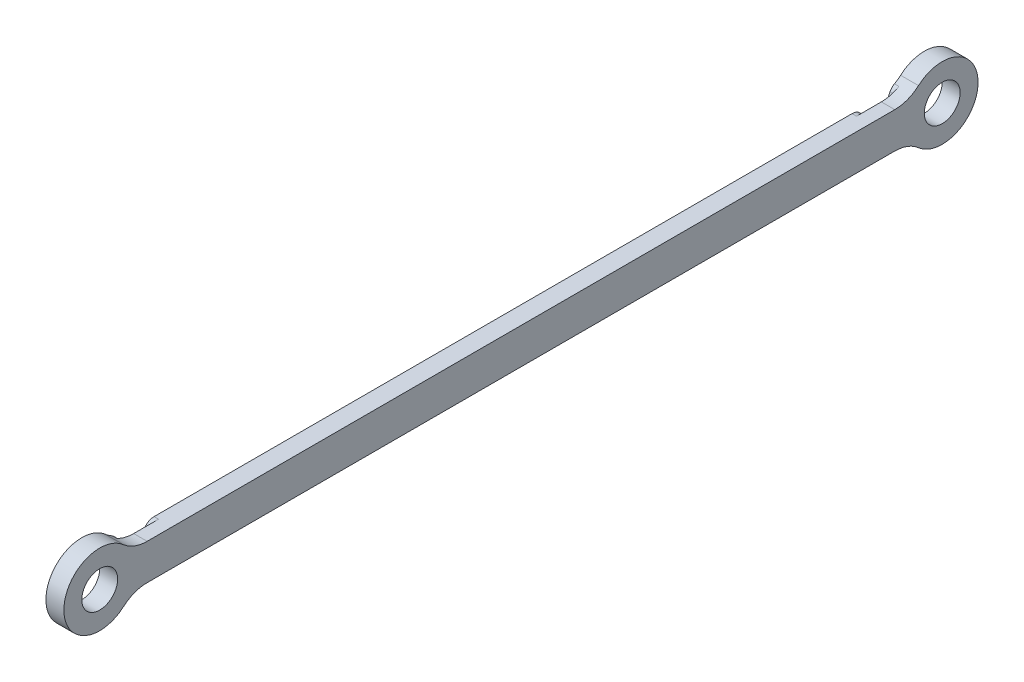
ISO-10303-21;
HEADER;
FILE_DESCRIPTION(('STEP AP214'),'2;1');
FILE_NAME('part.step','',(''),(''),'','','');
FILE_SCHEMA(('AUTOMOTIVE_DESIGN { 1 0 10303 214 1 1 1 1 }'));
ENDSEC;
DATA;
#1=APPLICATION_CONTEXT('core data for automotive mechanical design processes');
#2=APPLICATION_PROTOCOL_DEFINITION('international standard','automotive_design',2000,#1);
#3=PRODUCT_CONTEXT('',#1,'mechanical');
#4=PRODUCT('Part','Part','',(#3));
#5=PRODUCT_RELATED_PRODUCT_CATEGORY('part','',(#4));
#6=PRODUCT_DEFINITION_FORMATION('','',#4);
#7=PRODUCT_DEFINITION_CONTEXT('part definition',#1,'design');
#8=PRODUCT_DEFINITION('design','',#6,#7);
#9=PRODUCT_DEFINITION_SHAPE('','',#8);
#10=(LENGTH_UNIT() NAMED_UNIT(*) SI_UNIT(.MILLI.,.METRE.));
#11=(NAMED_UNIT(*) PLANE_ANGLE_UNIT() SI_UNIT($,.RADIAN.));
#12=(NAMED_UNIT(*) SI_UNIT($,.STERADIAN.) SOLID_ANGLE_UNIT());
#13=UNCERTAINTY_MEASURE_WITH_UNIT(LENGTH_MEASURE(1.E-05),#10,'distance_accuracy_value','');
#14=(GEOMETRIC_REPRESENTATION_CONTEXT(3) GLOBAL_UNCERTAINTY_ASSIGNED_CONTEXT((#13)) GLOBAL_UNIT_ASSIGNED_CONTEXT((#10,
#11,#12)) REPRESENTATION_CONTEXT('',''));
#15=CARTESIAN_POINT('',(0.,0.,0.));
#16=DIRECTION('',(0.,0.,1.));
#17=DIRECTION('',(1.,0.,0.));
#18=AXIS2_PLACEMENT_3D('',#15,#16,#17);
#19=CARTESIAN_POINT('',(-1.5875,0.,0.));
#20=DIRECTION('',(1.,0.,0.));
#21=DIRECTION('',(0.,0.,-1.));
#22=AXIS2_PLACEMENT_3D('',#19,#20,#21);
#23=PLANE('',#22);
#24=CARTESIAN_POINT('',(-1.5875,0.,-149.225));
#25=DIRECTION('',(1.,0.,0.));
#26=DIRECTION('',(0.,0.,-1.));
#27=AXIS2_PLACEMENT_3D('',#24,#25,#26);
#28=CIRCLE('',#27,3.175);
#29=CARTESIAN_POINT('',(-1.5875,0.,-152.4));
#30=VERTEX_POINT('',#29);
#31=EDGE_CURVE('E364',#30,#30,#28,.T.);
#32=ORIENTED_EDGE('',*,*,#31,.T.);
#33=EDGE_LOOP('',(#32));
#34=FACE_BOUND('',#33,.T.);
#35=CARTESIAN_POINT('',(-1.5875,0.,-149.225));
#36=DIRECTION('',(1.,0.,0.));
#37=DIRECTION('',(0.,0.,-1.));
#38=AXIS2_PLACEMENT_3D('',#35,#36,#37);
#39=CIRCLE('',#38,6.858);
#40=CARTESIAN_POINT('',(-1.5875,-3.1721686456571,-143.144744241933));
#41=VERTEX_POINT('',#40);
#42=CARTESIAN_POINT('',(-1.5875,3.1721686456571,-143.144744241933));
#43=VERTEX_POINT('',#42);
#44=EDGE_CURVE('E498',#41,#43,#39,.F.);
#45=ORIENTED_EDGE('',*,*,#44,.T.);
#46=CARTESIAN_POINT('',(-1.5875,2.24706842820096,-144.917930523084));
#47=DIRECTION('',(1.,0.,0.));
#48=DIRECTION('',(0.,0.,-1.));
#49=AXIS2_PLACEMENT_3D('',#46,#47,#48);
#50=CIRCLE('',#49,2.);
#51=CARTESIAN_POINT('',(-1.5875,3.99028557114684,-143.937525508542));
#52=VERTEX_POINT('',#51);
#53=EDGE_CURVE('E290',#43,#52,#50,.F.);
#54=ORIENTED_EDGE('',*,*,#53,.T.);
#55=CARTESIAN_POINT('',(-1.5875,9.525,-140.82473958737));
#56=DIRECTION('',(1.,0.,0.));
#57=DIRECTION('',(0.,0.,-1.));
#58=AXIS2_PLACEMENT_3D('',#55,#56,#57);
#59=CIRCLE('',#58,6.35);
#60=CARTESIAN_POINT('',(-1.5875,4.76249999999999,-145.024869793685));
#61=VERTEX_POINT('',#60);
#62=EDGE_CURVE('E246',#52,#61,#59,.T.);
#63=ORIENTED_EDGE('',*,*,#62,.T.);
#64=CARTESIAN_POINT('',(-1.5875,0.,-149.225));
#65=DIRECTION('',(1.,0.,0.));
#66=DIRECTION('',(0.,0.,-1.));
#67=AXIS2_PLACEMENT_3D('',#64,#65,#66);
#68=CIRCLE('',#67,6.35);
#69=CARTESIAN_POINT('',(-1.5875,-4.76249999999999,-145.024869793685));
#70=VERTEX_POINT('',#69);
#71=EDGE_CURVE('E351',#70,#61,#68,.T.);
#72=ORIENTED_EDGE('',*,*,#71,.F.);
#73=CARTESIAN_POINT('',(-1.5875,-9.525,-140.82473958737));
#74=DIRECTION('',(1.,0.,0.));
#75=DIRECTION('',(0.,0.,-1.));
#76=AXIS2_PLACEMENT_3D('',#73,#74,#75);
#77=CIRCLE('',#76,6.35);
#78=CARTESIAN_POINT('',(-1.5875,-3.99028557114684,-143.937525508542));
#79=VERTEX_POINT('',#78);
#80=EDGE_CURVE('E250',#70,#79,#77,.T.);
#81=ORIENTED_EDGE('',*,*,#80,.T.);
#82=CARTESIAN_POINT('',(-1.5875,-2.24706842820097,-144.917930523084));
#83=DIRECTION('',(1.,0.,0.));
#84=DIRECTION('',(0.,0.,-1.));
#85=AXIS2_PLACEMENT_3D('',#82,#83,#84);
#86=CIRCLE('',#85,2.);
#87=EDGE_CURVE('E288',#79,#41,#86,.F.);
#88=ORIENTED_EDGE('',*,*,#87,.T.);
#89=EDGE_LOOP('',(#45,#54,#63,#72,#81,#88));
#90=FACE_BOUND('',#89,.T.);
#91=ADVANCED_FACE('F37',(#34,#90),#23,.F.);
#92=CARTESIAN_POINT('',(1.5875,9.525,-140.82473958737));
#93=DIRECTION('',(-1.,0.,0.));
#94=DIRECTION('',(0.,0.,1.));
#95=AXIS2_PLACEMENT_3D('',#92,#93,#94);
#96=CYLINDRICAL_SURFACE('',#95,6.35);
#97=ORIENTED_EDGE('',*,*,#62,.F.);
#98=DIRECTION('',(-1.,0.,0.));
#99=VECTOR('',#98,1.);
#100=CARTESIAN_POINT('',(1.5875,3.99028557114684,-143.937525508542));
#101=LINE('',#100,#99);
#102=CARTESIAN_POINT('',(-0.79375,3.99028557114684,-143.937525508542));
#103=VERTEX_POINT('',#102);
#104=EDGE_CURVE('E217',#52,#103,#101,.F.);
#105=ORIENTED_EDGE('',*,*,#104,.T.);
#106=CARTESIAN_POINT('',(-0.79375,9.525,-140.82473958737));
#107=DIRECTION('',(1.,0.,0.));
#108=DIRECTION('',(0.,0.,-1.));
#109=AXIS2_PLACEMENT_3D('',#106,#107,#108);
#110=CIRCLE('',#109,6.35);
#111=CARTESIAN_POINT('',(-0.79375,3.175,-140.82473958737));
#112=VERTEX_POINT('',#111);
#113=EDGE_CURVE('E199',#103,#112,#110,.F.);
#114=ORIENTED_EDGE('',*,*,#113,.T.);
#115=DIRECTION('',(-1.,0.,0.));
#116=VECTOR('',#115,1.);
#117=CARTESIAN_POINT('',(1.5875,3.175,-140.82473958737));
#118=LINE('',#117,#116);
#119=CARTESIAN_POINT('',(1.5875,3.175,-140.82473958737));
#120=VERTEX_POINT('',#119);
#121=EDGE_CURVE('E215',#120,#112,#118,.T.);
#122=ORIENTED_EDGE('',*,*,#121,.F.);
#123=CARTESIAN_POINT('',(1.5875,9.525,-140.82473958737));
#124=DIRECTION('',(1.,0.,0.));
#125=DIRECTION('',(0.,0.,-1.));
#126=AXIS2_PLACEMENT_3D('',#123,#124,#125);
#127=CIRCLE('',#126,6.35);
#128=CARTESIAN_POINT('',(1.5875,4.76249999999999,-145.024869793685));
#129=VERTEX_POINT('',#128);
#130=EDGE_CURVE('E248',#129,#120,#127,.F.);
#131=ORIENTED_EDGE('',*,*,#130,.F.);
#132=DIRECTION('',(-1.,0.,0.));
#133=VECTOR('',#132,1.);
#134=CARTESIAN_POINT('',(1.5875,4.76249999999999,-145.024869793685));
#135=LINE('',#134,#133);
#136=EDGE_CURVE('E229',#61,#129,#135,.F.);
#137=ORIENTED_EDGE('',*,*,#136,.F.);
#138=EDGE_LOOP('',(#97,#105,#114,#122,#131,#137));
#139=FACE_BOUND('',#138,.T.);
#140=ADVANCED_FACE('F213',(#139),#96,.F.);
#141=CARTESIAN_POINT('',(1.5875,-9.525,-140.82473958737));
#142=DIRECTION('',(-1.,0.,0.));
#143=DIRECTION('',(0.,0.,1.));
#144=AXIS2_PLACEMENT_3D('',#141,#142,#143);
#145=CYLINDRICAL_SURFACE('',#144,6.35);
#146=CARTESIAN_POINT('',(-0.79375,-9.525,-140.82473958737));
#147=DIRECTION('',(1.,0.,0.));
#148=DIRECTION('',(0.,0.,-1.));
#149=AXIS2_PLACEMENT_3D('',#146,#147,#148);
#150=CIRCLE('',#149,6.35);
#151=CARTESIAN_POINT('',(-0.79375,-3.175,-140.82473958737));
#152=VERTEX_POINT('',#151);
#153=CARTESIAN_POINT('',(-0.79375,-3.99028557114684,-143.937525508542));
#154=VERTEX_POINT('',#153);
#155=EDGE_CURVE('E485',#152,#154,#150,.F.);
#156=ORIENTED_EDGE('',*,*,#155,.T.);
#157=DIRECTION('',(-1.,0.,0.));
#158=VECTOR('',#157,1.);
#159=CARTESIAN_POINT('',(1.5875,-3.99028557114684,-143.937525508542));
#160=LINE('',#159,#158);
#161=EDGE_CURVE('E298',#154,#79,#160,.T.);
#162=ORIENTED_EDGE('',*,*,#161,.T.);
#163=ORIENTED_EDGE('',*,*,#80,.F.);
#164=DIRECTION('',(-1.,0.,0.));
#165=VECTOR('',#164,1.);
#166=CARTESIAN_POINT('',(1.5875,-4.76249999999999,-145.024869793685));
#167=LINE('',#166,#165);
#168=CARTESIAN_POINT('',(1.5875,-4.76249999999999,-145.024869793685));
#169=VERTEX_POINT('',#168);
#170=EDGE_CURVE('E225',#169,#70,#167,.T.);
#171=ORIENTED_EDGE('',*,*,#170,.F.);
#172=CARTESIAN_POINT('',(1.5875,-9.525,-140.82473958737));
#173=DIRECTION('',(1.,0.,0.));
#174=DIRECTION('',(0.,0.,-1.));
#175=AXIS2_PLACEMENT_3D('',#172,#173,#174);
#176=CIRCLE('',#175,6.35);
#177=CARTESIAN_POINT('',(1.5875,-3.175,-140.82473958737));
#178=VERTEX_POINT('',#177);
#179=EDGE_CURVE('E253',#178,#169,#176,.F.);
#180=ORIENTED_EDGE('',*,*,#179,.F.);
#181=DIRECTION('',(1.,0.,0.));
#182=VECTOR('',#181,1.);
#183=CARTESIAN_POINT('',(1.5875,-3.175,-140.82473958737));
#184=LINE('',#183,#182);
#185=EDGE_CURVE('E239',#152,#178,#184,.T.);
#186=ORIENTED_EDGE('',*,*,#185,.F.);
#187=EDGE_LOOP('',(#156,#162,#163,#171,#180,#186));
#188=FACE_BOUND('',#187,.T.);
#189=ADVANCED_FACE('F415',(#188),#145,.F.);
#190=CARTESIAN_POINT('',(1.5875,-3.175,0.));
#191=DIRECTION('',(0.,1.,0.));
#192=DIRECTION('',(0.,0.,1.));
#193=AXIS2_PLACEMENT_3D('',#190,#191,#192);
#194=PLANE('',#193);
#195=DIRECTION('',(0.,0.,-1.));
#196=VECTOR('',#195,1.);
#197=CARTESIAN_POINT('',(-1.5875,-3.175,0.));
#198=LINE('',#197,#196);
#199=CARTESIAN_POINT('',(-1.5875,-3.175,-12.8042001816454));
#200=VERTEX_POINT('',#199);
#201=CARTESIAN_POINT('',(-1.5875,-3.175,-136.420799818355));
#202=VERTEX_POINT('',#201);
#203=EDGE_CURVE('E345',#200,#202,#198,.T.);
#204=ORIENTED_EDGE('',*,*,#203,.T.);
#205=DIRECTION('',(-1.,0.,0.));
#206=VECTOR('',#205,1.);
#207=CARTESIAN_POINT('',(1.5875,-3.175,-136.420799818355));
#208=LINE('',#207,#206);
#209=CARTESIAN_POINT('',(-0.79375,-3.175,-136.420799818355));
#210=VERTEX_POINT('',#209);
#211=EDGE_CURVE('E280',#202,#210,#208,.F.);
#212=ORIENTED_EDGE('',*,*,#211,.T.);
#213=DIRECTION('',(0.,0.,-1.));
#214=VECTOR('',#213,1.);
#215=CARTESIAN_POINT('',(-0.79375,-3.175,-149.225));
#216=LINE('',#215,#214);
#217=EDGE_CURVE('E482',#210,#152,#216,.T.);
#218=ORIENTED_EDGE('',*,*,#217,.T.);
#219=ORIENTED_EDGE('',*,*,#185,.T.);
#220=DIRECTION('',(0.,0.,-1.));
#221=VECTOR('',#220,1.);
#222=CARTESIAN_POINT('',(1.5875,-3.175,0.));
#223=LINE('',#222,#221);
#224=CARTESIAN_POINT('',(1.5875,-3.175,-8.40026041263007));
#225=VERTEX_POINT('',#224);
#226=EDGE_CURVE('E372',#225,#178,#223,.T.);
#227=ORIENTED_EDGE('',*,*,#226,.F.);
#228=DIRECTION('',(1.,0.,0.));
#229=VECTOR('',#228,1.);
#230=CARTESIAN_POINT('',(-1.5875,-3.175,-8.40026041263007));
#231=LINE('',#230,#229);
#232=CARTESIAN_POINT('',(-0.79375,-3.175,-8.40026041263007));
#233=VERTEX_POINT('',#232);
#234=EDGE_CURVE('E236',#225,#233,#231,.F.);
#235=ORIENTED_EDGE('',*,*,#234,.T.);
#236=DIRECTION('',(0.,0.,1.));
#237=VECTOR('',#236,1.);
#238=CARTESIAN_POINT('',(-0.79375,-3.175,0.));
#239=LINE('',#238,#237);
#240=CARTESIAN_POINT('',(-0.79375,-3.175,-12.8042001816454));
#241=VERTEX_POINT('',#240);
#242=EDGE_CURVE('E336',#241,#233,#239,.T.);
#243=ORIENTED_EDGE('',*,*,#242,.F.);
#244=DIRECTION('',(1.,0.,0.));
#245=VECTOR('',#244,1.);
#246=CARTESIAN_POINT('',(-1.5875,-3.175,-12.8042001816454));
#247=LINE('',#246,#245);
#248=EDGE_CURVE('E277',#241,#200,#247,.F.);
#249=ORIENTED_EDGE('',*,*,#248,.T.);
#250=EDGE_LOOP('',(#204,#212,#218,#219,#227,#235,#243,#249));
#251=FACE_BOUND('',#250,.T.);
#252=ADVANCED_FACE('F344',(#251),#194,.F.);
#253=CARTESIAN_POINT('',(1.5875,3.175,0.));
#254=DIRECTION('',(0.,1.,0.));
#255=DIRECTION('',(0.,0.,1.));
#256=AXIS2_PLACEMENT_3D('',#253,#254,#255);
#257=PLANE('',#256);
#258=DIRECTION('',(0.,0.,1.));
#259=VECTOR('',#258,1.);
#260=CARTESIAN_POINT('',(-0.79375,3.175,-149.225));
#261=LINE('',#260,#259);
#262=CARTESIAN_POINT('',(-0.79375,3.175,-136.420799818355));
#263=VERTEX_POINT('',#262);
#264=EDGE_CURVE('E196',#112,#263,#261,.T.);
#265=ORIENTED_EDGE('',*,*,#264,.T.);
#266=DIRECTION('',(1.,0.,0.));
#267=VECTOR('',#266,1.);
#268=CARTESIAN_POINT('',(-1.5875,3.175,-136.420799818355));
#269=LINE('',#268,#267);
#270=CARTESIAN_POINT('',(-1.5875,3.175,-136.420799818355));
#271=VERTEX_POINT('',#270);
#272=EDGE_CURVE('E296',#263,#271,#269,.F.);
#273=ORIENTED_EDGE('',*,*,#272,.T.);
#274=DIRECTION('',(0.,0.,-1.));
#275=VECTOR('',#274,1.);
#276=CARTESIAN_POINT('',(-1.5875,3.175,0.));
#277=LINE('',#276,#275);
#278=CARTESIAN_POINT('',(-1.5875,3.175,-12.8042001816454));
#279=VERTEX_POINT('',#278);
#280=EDGE_CURVE('E355',#279,#271,#277,.T.);
#281=ORIENTED_EDGE('',*,*,#280,.F.);
#282=DIRECTION('',(-1.,0.,0.));
#283=VECTOR('',#282,1.);
#284=CARTESIAN_POINT('',(1.5875,3.175,-12.8042001816454));
#285=LINE('',#284,#283);
#286=CARTESIAN_POINT('',(-0.79375,3.175,-12.8042001816454));
#287=VERTEX_POINT('',#286);
#288=EDGE_CURVE('E293',#279,#287,#285,.F.);
#289=ORIENTED_EDGE('',*,*,#288,.T.);
#290=DIRECTION('',(0.,0.,-1.));
#291=VECTOR('',#290,1.);
#292=CARTESIAN_POINT('',(-0.79375,3.175,0.));
#293=LINE('',#292,#291);
#294=CARTESIAN_POINT('',(-0.79375,3.175,-8.40026041263007));
#295=VERTEX_POINT('',#294);
#296=EDGE_CURVE('E358',#295,#287,#293,.T.);
#297=ORIENTED_EDGE('',*,*,#296,.F.);
#298=DIRECTION('',(-1.,0.,0.));
#299=VECTOR('',#298,1.);
#300=CARTESIAN_POINT('',(1.5875,3.175,-8.40026041263007));
#301=LINE('',#300,#299);
#302=CARTESIAN_POINT('',(1.5875,3.175,-8.40026041263007));
#303=VERTEX_POINT('',#302);
#304=EDGE_CURVE('E226',#295,#303,#301,.F.);
#305=ORIENTED_EDGE('',*,*,#304,.T.);
#306=DIRECTION('',(0.,0.,-1.));
#307=VECTOR('',#306,1.);
#308=CARTESIAN_POINT('',(1.5875,3.175,0.));
#309=LINE('',#308,#307);
#310=EDGE_CURVE('E224',#303,#120,#309,.T.);
#311=ORIENTED_EDGE('',*,*,#310,.T.);
#312=ORIENTED_EDGE('',*,*,#121,.T.);
#313=EDGE_LOOP('',(#265,#273,#281,#289,#297,#305,#311,#312));
#314=FACE_BOUND('',#313,.T.);
#315=ADVANCED_FACE('F222',(#314),#257,.T.);
#316=CARTESIAN_POINT('',(-1.5875,0.,-149.225));
#317=DIRECTION('',(1.,0.,0.));
#318=DIRECTION('',(0.,0.,-1.));
#319=AXIS2_PLACEMENT_3D('',#316,#317,#318);
#320=CIRCLE('',#319,10.858000128);
#321=CARTESIAN_POINT('',(-1.5875,-0.992234408414526,-138.412431495782));
#322=VERTEX_POINT('',#321);
#323=CARTESIAN_POINT('',(-1.5875,0.992234408414526,-138.412431495782));
#324=VERTEX_POINT('',#323);
#325=EDGE_CURVE('E501',#322,#324,#320,.F.);
#326=ORIENTED_EDGE('',*,*,#325,.F.);
#327=CARTESIAN_POINT('',(-1.5875,-1.175,-136.420799818355));
#328=DIRECTION('',(1.,0.,0.));
#329=DIRECTION('',(0.,0.,-1.));
#330=AXIS2_PLACEMENT_3D('',#327,#328,#329);
#331=CIRCLE('',#330,2.);
#332=EDGE_CURVE('E275',#322,#202,#331,.F.);
#333=ORIENTED_EDGE('',*,*,#332,.T.);
#334=ORIENTED_EDGE('',*,*,#203,.F.);
#335=CARTESIAN_POINT('',(-1.5875,-1.175,-12.8042001816454));
#336=DIRECTION('',(1.,0.,0.));
#337=DIRECTION('',(0.,0.,-1.));
#338=AXIS2_PLACEMENT_3D('',#335,#336,#337);
#339=CIRCLE('',#338,2.);
#340=CARTESIAN_POINT('',(-1.5875,-0.992234408414528,-10.812568504218));
#341=VERTEX_POINT('',#340);
#342=EDGE_CURVE('E271',#200,#341,#339,.F.);
#343=ORIENTED_EDGE('',*,*,#342,.T.);
#344=CARTESIAN_POINT('',(-1.5875,0.,0.));
#345=DIRECTION('',(-1.,0.,0.));
#346=DIRECTION('',(0.,0.,1.));
#347=AXIS2_PLACEMENT_3D('',#344,#345,#346);
#348=CIRCLE('',#347,10.858000128);
#349=CARTESIAN_POINT('',(-1.5875,0.992234408414528,-10.812568504218));
#350=VERTEX_POINT('',#349);
#351=EDGE_CURVE('E480',#341,#350,#348,.F.);
#352=ORIENTED_EDGE('',*,*,#351,.T.);
#353=CARTESIAN_POINT('',(-1.5875,1.175,-12.8042001816454));
#354=DIRECTION('',(1.,0.,0.));
#355=DIRECTION('',(0.,0.,-1.));
#356=AXIS2_PLACEMENT_3D('',#353,#354,#355);
#357=CIRCLE('',#356,2.);
#358=EDGE_CURVE('E269',#350,#279,#357,.F.);
#359=ORIENTED_EDGE('',*,*,#358,.T.);
#360=ORIENTED_EDGE('',*,*,#280,.T.);
#361=CARTESIAN_POINT('',(-1.5875,1.175,-136.420799818355));
#362=DIRECTION('',(1.,0.,0.));
#363=DIRECTION('',(0.,0.,-1.));
#364=AXIS2_PLACEMENT_3D('',#361,#362,#363);
#365=CIRCLE('',#364,2.);
#366=EDGE_CURVE('E273',#271,#324,#365,.F.);
#367=ORIENTED_EDGE('',*,*,#366,.T.);
#368=EDGE_LOOP('',(#326,#333,#334,#343,#352,#359,#360,#367));
#369=FACE_BOUND('',#368,.T.);
#370=ADVANCED_FACE('F349',(#369),#23,.F.);
#371=CARTESIAN_POINT('',(1.5875,0.,0.));
#372=DIRECTION('',(-1.,0.,0.));
#373=DIRECTION('',(0.,0.,1.));
#374=AXIS2_PLACEMENT_3D('',#371,#372,#373);
#375=CYLINDRICAL_SURFACE('',#374,6.35);
#376=CARTESIAN_POINT('',(-1.5875,0.,0.));
#377=DIRECTION('',(1.,0.,0.));
#378=DIRECTION('',(0.,0.,-1.));
#379=AXIS2_PLACEMENT_3D('',#376,#377,#378);
#380=CIRCLE('',#379,6.35);
#381=CARTESIAN_POINT('',(-1.5875,4.7625,-4.20013020631504));
#382=VERTEX_POINT('',#381);
#383=CARTESIAN_POINT('',(-1.5875,-4.7625,-4.20013020631504));
#384=VERTEX_POINT('',#383);
#385=EDGE_CURVE('E352',#382,#384,#380,.T.);
#386=ORIENTED_EDGE('',*,*,#385,.T.);
#387=DIRECTION('',(-1.,0.,0.));
#388=VECTOR('',#387,1.);
#389=CARTESIAN_POINT('',(1.5875,-4.7625,-4.20013020631504));
#390=LINE('',#389,#388);
#391=CARTESIAN_POINT('',(1.5875,-4.7625,-4.20013020631504));
#392=VERTEX_POINT('',#391);
#393=EDGE_CURVE('E244',#384,#392,#390,.F.);
#394=ORIENTED_EDGE('',*,*,#393,.T.);
#395=CARTESIAN_POINT('',(1.5875,0.,0.));
#396=DIRECTION('',(1.,0.,0.));
#397=DIRECTION('',(0.,0.,-1.));
#398=AXIS2_PLACEMENT_3D('',#395,#396,#397);
#399=CIRCLE('',#398,6.35);
#400=CARTESIAN_POINT('',(1.5875,4.7625,-4.20013020631504));
#401=VERTEX_POINT('',#400);
#402=EDGE_CURVE('E368',#401,#392,#399,.T.);
#403=ORIENTED_EDGE('',*,*,#402,.F.);
#404=DIRECTION('',(-1.,0.,0.));
#405=VECTOR('',#404,1.);
#406=CARTESIAN_POINT('',(1.5875,4.7625,-4.20013020631504));
#407=LINE('',#406,#405);
#408=EDGE_CURVE('E241',#401,#382,#407,.T.);
#409=ORIENTED_EDGE('',*,*,#408,.T.);
#410=EDGE_LOOP('',(#386,#394,#403,#409));
#411=FACE_BOUND('',#410,.T.);
#412=ADVANCED_FACE('F419',(#411),#375,.T.);
#413=CARTESIAN_POINT('',(1.5875,0.,-149.225));
#414=DIRECTION('',(-1.,0.,0.));
#415=DIRECTION('',(0.,0.,1.));
#416=AXIS2_PLACEMENT_3D('',#413,#414,#415);
#417=CYLINDRICAL_SURFACE('',#416,6.35);
#418=ORIENTED_EDGE('',*,*,#71,.T.);
#419=ORIENTED_EDGE('',*,*,#136,.T.);
#420=CARTESIAN_POINT('',(1.5875,0.,-149.225));
#421=DIRECTION('',(1.,0.,0.));
#422=DIRECTION('',(0.,0.,-1.));
#423=AXIS2_PLACEMENT_3D('',#420,#421,#422);
#424=CIRCLE('',#423,6.35);
#425=EDGE_CURVE('E378',#169,#129,#424,.T.);
#426=ORIENTED_EDGE('',*,*,#425,.F.);
#427=ORIENTED_EDGE('',*,*,#170,.T.);
#428=EDGE_LOOP('',(#418,#419,#426,#427));
#429=FACE_BOUND('',#428,.T.);
#430=ADVANCED_FACE('F424',(#429),#417,.T.);
#431=CARTESIAN_POINT('',(1.5875,0.,-149.225));
#432=DIRECTION('',(-1.,0.,0.));
#433=DIRECTION('',(0.,0.,1.));
#434=AXIS2_PLACEMENT_3D('',#431,#432,#433);
#435=CYLINDRICAL_SURFACE('',#434,3.175);
#436=CARTESIAN_POINT('',(1.5875,0.,-149.225));
#437=DIRECTION('',(1.,0.,0.));
#438=DIRECTION('',(0.,0.,-1.));
#439=AXIS2_PLACEMENT_3D('',#436,#437,#438);
#440=CIRCLE('',#439,3.175);
#441=CARTESIAN_POINT('',(1.5875,0.,-152.4));
#442=VERTEX_POINT('',#441);
#443=EDGE_CURVE('E387',#442,#442,#440,.T.);
#444=ORIENTED_EDGE('',*,*,#443,.T.);
#445=EDGE_LOOP('',(#444));
#446=FACE_BOUND('',#445,.T.);
#447=ORIENTED_EDGE('',*,*,#31,.F.);
#448=EDGE_LOOP('',(#447));
#449=FACE_BOUND('',#448,.T.);
#450=ADVANCED_FACE('F406',(#446,#449),#435,.F.);
#451=CARTESIAN_POINT('',(1.5875,0.,0.));
#452=DIRECTION('',(-1.,0.,0.));
#453=DIRECTION('',(0.,0.,1.));
#454=AXIS2_PLACEMENT_3D('',#451,#452,#453);
#455=CYLINDRICAL_SURFACE('',#454,3.175);
#456=CARTESIAN_POINT('',(1.5875,0.,0.));
#457=DIRECTION('',(1.,0.,0.));
#458=DIRECTION('',(0.,0.,-1.));
#459=AXIS2_PLACEMENT_3D('',#456,#457,#458);
#460=CIRCLE('',#459,3.175);
#461=CARTESIAN_POINT('',(1.5875,0.,-3.175));
#462=VERTEX_POINT('',#461);
#463=EDGE_CURVE('E231',#462,#462,#460,.T.);
#464=ORIENTED_EDGE('',*,*,#463,.T.);
#465=EDGE_LOOP('',(#464));
#466=FACE_BOUND('',#465,.T.);
#467=CARTESIAN_POINT('',(-1.5875,0.,0.));
#468=DIRECTION('',(1.,0.,0.));
#469=DIRECTION('',(0.,0.,-1.));
#470=AXIS2_PLACEMENT_3D('',#467,#468,#469);
#471=CIRCLE('',#470,3.175);
#472=CARTESIAN_POINT('',(-1.5875,0.,-3.175));
#473=VERTEX_POINT('',#472);
#474=EDGE_CURVE('E366',#473,#473,#471,.T.);
#475=ORIENTED_EDGE('',*,*,#474,.F.);
#476=EDGE_LOOP('',(#475));
#477=FACE_BOUND('',#476,.T.);
#478=ADVANCED_FACE('F392',(#466,#477),#455,.F.);
#479=CARTESIAN_POINT('',(1.5875,0.,0.));
#480=DIRECTION('',(1.,0.,0.));
#481=DIRECTION('',(0.,0.,-1.));
#482=AXIS2_PLACEMENT_3D('',#479,#480,#481);
#483=PLANE('',#482);
#484=ORIENTED_EDGE('',*,*,#310,.F.);
#485=CARTESIAN_POINT('',(1.5875,9.525,-8.40026041263007));
#486=DIRECTION('',(1.,0.,0.));
#487=DIRECTION('',(0.,0.,-1.));
#488=AXIS2_PLACEMENT_3D('',#485,#486,#487);
#489=CIRCLE('',#488,6.35);
#490=EDGE_CURVE('E262',#303,#401,#489,.F.);
#491=ORIENTED_EDGE('',*,*,#490,.T.);
#492=ORIENTED_EDGE('',*,*,#402,.T.);
#493=CARTESIAN_POINT('',(1.5875,-9.525,-8.40026041263007));
#494=DIRECTION('',(1.,0.,0.));
#495=DIRECTION('',(0.,0.,-1.));
#496=AXIS2_PLACEMENT_3D('',#493,#494,#495);
#497=CIRCLE('',#496,6.35);
#498=EDGE_CURVE('E257',#392,#225,#497,.F.);
#499=ORIENTED_EDGE('',*,*,#498,.T.);
#500=ORIENTED_EDGE('',*,*,#226,.T.);
#501=ORIENTED_EDGE('',*,*,#179,.T.);
#502=ORIENTED_EDGE('',*,*,#425,.T.);
#503=ORIENTED_EDGE('',*,*,#130,.T.);
#504=EDGE_LOOP('',(#484,#491,#492,#499,#500,#501,#502,#503));
#505=FACE_BOUND('',#504,.T.);
#506=ORIENTED_EDGE('',*,*,#443,.F.);
#507=EDGE_LOOP('',(#506));
#508=FACE_BOUND('',#507,.T.);
#509=ORIENTED_EDGE('',*,*,#463,.F.);
#510=EDGE_LOOP('',(#509));
#511=FACE_BOUND('',#510,.T.);
#512=ADVANCED_FACE('F395',(#505,#508,#511),#483,.T.);
#513=CARTESIAN_POINT('',(-1.5875,9.525,-8.40026041263007));
#514=DIRECTION('',(1.,0.,0.));
#515=DIRECTION('',(0.,0.,-1.));
#516=AXIS2_PLACEMENT_3D('',#513,#514,#515);
#517=CIRCLE('',#516,6.35);
#518=CARTESIAN_POINT('',(-1.5875,3.99028557114685,-5.28747449145837));
#519=VERTEX_POINT('',#518);
#520=EDGE_CURVE('E259',#382,#519,#517,.T.);
#521=ORIENTED_EDGE('',*,*,#520,.T.);
#522=CARTESIAN_POINT('',(-1.5875,2.24706842820098,-4.30706947691611));
#523=DIRECTION('',(1.,0.,0.));
#524=DIRECTION('',(0.,0.,-1.));
#525=AXIS2_PLACEMENT_3D('',#522,#523,#524);
#526=CIRCLE('',#525,2.);
#527=CARTESIAN_POINT('',(-1.5875,3.17216864565712,-6.08025575806724));
#528=VERTEX_POINT('',#527);
#529=EDGE_CURVE('E306',#519,#528,#526,.F.);
#530=ORIENTED_EDGE('',*,*,#529,.T.);
#531=CARTESIAN_POINT('',(-1.5875,0.,0.));
#532=DIRECTION('',(-1.,0.,0.));
#533=DIRECTION('',(0.,0.,1.));
#534=AXIS2_PLACEMENT_3D('',#531,#532,#533);
#535=CIRCLE('',#534,6.858);
#536=CARTESIAN_POINT('',(-1.5875,-3.17216864565712,-6.08025575806724));
#537=VERTEX_POINT('',#536);
#538=EDGE_CURVE('E381',#537,#528,#535,.F.);
#539=ORIENTED_EDGE('',*,*,#538,.F.);
#540=CARTESIAN_POINT('',(-1.5875,-2.24706842820097,-4.30706947691611));
#541=DIRECTION('',(1.,0.,0.));
#542=DIRECTION('',(0.,0.,-1.));
#543=AXIS2_PLACEMENT_3D('',#540,#541,#542);
#544=CIRCLE('',#543,2.);
#545=CARTESIAN_POINT('',(-1.5875,-3.99028557114685,-5.28747449145838));
#546=VERTEX_POINT('',#545);
#547=EDGE_CURVE('E304',#537,#546,#544,.F.);
#548=ORIENTED_EDGE('',*,*,#547,.T.);
#549=CARTESIAN_POINT('',(-1.5875,-9.525,-8.40026041263007));
#550=DIRECTION('',(1.,0.,0.));
#551=DIRECTION('',(0.,0.,-1.));
#552=AXIS2_PLACEMENT_3D('',#549,#550,#551);
#553=CIRCLE('',#552,6.35);
#554=EDGE_CURVE('E255',#546,#384,#553,.T.);
#555=ORIENTED_EDGE('',*,*,#554,.T.);
#556=ORIENTED_EDGE('',*,*,#385,.F.);
#557=EDGE_LOOP('',(#521,#530,#539,#548,#555,#556));
#558=FACE_BOUND('',#557,.T.);
#559=ORIENTED_EDGE('',*,*,#474,.T.);
#560=EDGE_LOOP('',(#559));
#561=FACE_BOUND('',#560,.T.);
#562=ADVANCED_FACE('F397',(#558,#561),#23,.F.);
#563=CARTESIAN_POINT('',(1.5875,-9.525,-8.40026041263007));
#564=DIRECTION('',(-1.,0.,0.));
#565=DIRECTION('',(0.,0.,1.));
#566=AXIS2_PLACEMENT_3D('',#563,#564,#565);
#567=CYLINDRICAL_SURFACE('',#566,6.35);
#568=ORIENTED_EDGE('',*,*,#554,.F.);
#569=DIRECTION('',(-1.,0.,0.));
#570=VECTOR('',#569,1.);
#571=CARTESIAN_POINT('',(1.5875,-3.99028557114685,-5.28747449145838));
#572=LINE('',#571,#570);
#573=CARTESIAN_POINT('',(-0.79375,-3.99028557114685,-5.28747449145838));
#574=VERTEX_POINT('',#573);
#575=EDGE_CURVE('E313',#546,#574,#572,.F.);
#576=ORIENTED_EDGE('',*,*,#575,.T.);
#577=CARTESIAN_POINT('',(-0.79375,-9.525,-8.40026041263007));
#578=DIRECTION('',(-1.,0.,0.));
#579=DIRECTION('',(0.,0.,1.));
#580=AXIS2_PLACEMENT_3D('',#577,#578,#579);
#581=CIRCLE('',#580,6.35);
#582=EDGE_CURVE('E494',#233,#574,#581,.F.);
#583=ORIENTED_EDGE('',*,*,#582,.F.);
#584=ORIENTED_EDGE('',*,*,#234,.F.);
#585=ORIENTED_EDGE('',*,*,#498,.F.);
#586=ORIENTED_EDGE('',*,*,#393,.F.);
#587=EDGE_LOOP('',(#568,#576,#583,#584,#585,#586));
#588=FACE_BOUND('',#587,.T.);
#589=ADVANCED_FACE('F403',(#588),#567,.F.);
#590=CARTESIAN_POINT('',(1.5875,9.525,-8.40026041263007));
#591=DIRECTION('',(-1.,0.,0.));
#592=DIRECTION('',(0.,0.,1.));
#593=AXIS2_PLACEMENT_3D('',#590,#591,#592);
#594=CYLINDRICAL_SURFACE('',#593,6.35);
#595=CARTESIAN_POINT('',(-0.79375,9.525,-8.40026041263007));
#596=DIRECTION('',(-1.,0.,0.));
#597=DIRECTION('',(0.,0.,1.));
#598=AXIS2_PLACEMENT_3D('',#595,#596,#597);
#599=CIRCLE('',#598,6.35);
#600=CARTESIAN_POINT('',(-0.79375,3.99028557114685,-5.28747449145837));
#601=VERTEX_POINT('',#600);
#602=EDGE_CURVE('E489',#601,#295,#599,.F.);
#603=ORIENTED_EDGE('',*,*,#602,.F.);
#604=DIRECTION('',(-1.,0.,0.));
#605=VECTOR('',#604,1.);
#606=CARTESIAN_POINT('',(1.5875,3.99028557114685,-5.28747449145837));
#607=LINE('',#606,#605);
#608=EDGE_CURVE('E301',#601,#519,#607,.T.);
#609=ORIENTED_EDGE('',*,*,#608,.T.);
#610=ORIENTED_EDGE('',*,*,#520,.F.);
#611=ORIENTED_EDGE('',*,*,#408,.F.);
#612=ORIENTED_EDGE('',*,*,#490,.F.);
#613=ORIENTED_EDGE('',*,*,#304,.F.);
#614=EDGE_LOOP('',(#603,#609,#610,#611,#612,#613));
#615=FACE_BOUND('',#614,.T.);
#616=ADVANCED_FACE('F442',(#615),#594,.F.);
#617=CARTESIAN_POINT('',(-0.79375,0.,0.));
#618=DIRECTION('',(-1.,0.,0.));
#619=DIRECTION('',(0.,0.,1.));
#620=AXIS2_PLACEMENT_3D('',#617,#618,#619);
#621=CYLINDRICAL_SURFACE('',#620,10.858000128);
#622=ORIENTED_EDGE('',*,*,#351,.F.);
#623=DIRECTION('',(-1.,0.,0.));
#624=VECTOR('',#623,1.);
#625=CARTESIAN_POINT('',(-0.79375,-0.992234408414528,-10.812568504218));
#626=LINE('',#625,#624);
#627=CARTESIAN_POINT('',(-0.79375,-0.992234408414528,-10.812568504218));
#628=VERTEX_POINT('',#627);
#629=EDGE_CURVE('E57',#341,#628,#626,.F.);
#630=ORIENTED_EDGE('',*,*,#629,.T.);
#631=CARTESIAN_POINT('',(-0.79375,0.,0.));
#632=DIRECTION('',(-1.,0.,0.));
#633=DIRECTION('',(0.,0.,1.));
#634=AXIS2_PLACEMENT_3D('',#631,#632,#633);
#635=CIRCLE('',#634,10.858000128);
#636=CARTESIAN_POINT('',(-0.79375,0.992234408414528,-10.812568504218));
#637=VERTEX_POINT('',#636);
#638=EDGE_CURVE('E338',#628,#637,#635,.F.);
#639=ORIENTED_EDGE('',*,*,#638,.T.);
#640=DIRECTION('',(-1.,0.,0.));
#641=VECTOR('',#640,1.);
#642=CARTESIAN_POINT('',(-0.79375,0.992234408414528,-10.812568504218));
#643=LINE('',#642,#641);
#644=EDGE_CURVE('E316',#637,#350,#643,.T.);
#645=ORIENTED_EDGE('',*,*,#644,.T.);
#646=EDGE_LOOP('',(#622,#630,#639,#645));
#647=FACE_BOUND('',#646,.T.);
#648=ADVANCED_FACE('F446',(#647),#621,.F.);
#649=CARTESIAN_POINT('',(-0.79375,0.,0.));
#650=DIRECTION('',(-1.,0.,0.));
#651=DIRECTION('',(0.,0.,1.));
#652=AXIS2_PLACEMENT_3D('',#649,#650,#651);
#653=CYLINDRICAL_SURFACE('',#652,6.858);
#654=ORIENTED_EDGE('',*,*,#538,.T.);
#655=DIRECTION('',(-1.,0.,0.));
#656=VECTOR('',#655,1.);
#657=CARTESIAN_POINT('',(-0.79375,3.17216864565712,-6.08025575806724));
#658=LINE('',#657,#656);
#659=CARTESIAN_POINT('',(-0.79375,3.17216864565712,-6.08025575806724));
#660=VERTEX_POINT('',#659);
#661=EDGE_CURVE('E311',#528,#660,#658,.F.);
#662=ORIENTED_EDGE('',*,*,#661,.T.);
#663=CARTESIAN_POINT('',(-0.79375,0.,0.));
#664=DIRECTION('',(-1.,0.,0.));
#665=DIRECTION('',(0.,0.,1.));
#666=AXIS2_PLACEMENT_3D('',#663,#664,#665);
#667=CIRCLE('',#666,6.858);
#668=CARTESIAN_POINT('',(-0.79375,-3.17216864565712,-6.08025575806724));
#669=VERTEX_POINT('',#668);
#670=EDGE_CURVE('E491',#669,#660,#667,.F.);
#671=ORIENTED_EDGE('',*,*,#670,.F.);
#672=DIRECTION('',(-1.,0.,0.));
#673=VECTOR('',#672,1.);
#674=CARTESIAN_POINT('',(-0.79375,-3.17216864565712,-6.08025575806724));
#675=LINE('',#674,#673);
#676=EDGE_CURVE('E308',#669,#537,#675,.T.);
#677=ORIENTED_EDGE('',*,*,#676,.T.);
#678=EDGE_LOOP('',(#654,#662,#671,#677));
#679=FACE_BOUND('',#678,.T.);
#680=ADVANCED_FACE('F533',(#679),#653,.T.);
#681=CARTESIAN_POINT('',(-0.79375,0.,0.));
#682=DIRECTION('',(-1.,0.,0.));
#683=DIRECTION('',(0.,0.,1.));
#684=AXIS2_PLACEMENT_3D('',#681,#682,#683);
#685=PLANE('',#684);
#686=ORIENTED_EDGE('',*,*,#638,.F.);
#687=CARTESIAN_POINT('',(-0.79375,-1.175,-12.8042001816454));
#688=DIRECTION('',(-1.,0.,0.));
#689=DIRECTION('',(0.,0.,1.));
#690=AXIS2_PLACEMENT_3D('',#687,#688,#689);
#691=CIRCLE('',#690,2.);
#692=EDGE_CURVE('E45',#628,#241,#691,.F.);
#693=ORIENTED_EDGE('',*,*,#692,.T.);
#694=ORIENTED_EDGE('',*,*,#242,.T.);
#695=ORIENTED_EDGE('',*,*,#582,.T.);
#696=CARTESIAN_POINT('',(-0.79375,-2.24706842820097,-4.30706947691611));
#697=DIRECTION('',(-1.,0.,0.));
#698=DIRECTION('',(0.,0.,1.));
#699=AXIS2_PLACEMENT_3D('',#696,#697,#698);
#700=CIRCLE('',#699,2.);
#701=EDGE_CURVE('E331',#574,#669,#700,.F.);
#702=ORIENTED_EDGE('',*,*,#701,.T.);
#703=ORIENTED_EDGE('',*,*,#670,.T.);
#704=CARTESIAN_POINT('',(-0.79375,2.24706842820098,-4.30706947691611));
#705=DIRECTION('',(-1.,0.,0.));
#706=DIRECTION('',(0.,0.,1.));
#707=AXIS2_PLACEMENT_3D('',#704,#705,#706);
#708=CIRCLE('',#707,2.);
#709=EDGE_CURVE('E328',#660,#601,#708,.F.);
#710=ORIENTED_EDGE('',*,*,#709,.T.);
#711=ORIENTED_EDGE('',*,*,#602,.T.);
#712=ORIENTED_EDGE('',*,*,#296,.T.);
#713=CARTESIAN_POINT('',(-0.79375,1.175,-12.8042001816454));
#714=DIRECTION('',(-1.,0.,0.));
#715=DIRECTION('',(0.,0.,1.));
#716=AXIS2_PLACEMENT_3D('',#713,#714,#715);
#717=CIRCLE('',#716,2.);
#718=EDGE_CURVE('E11',#287,#637,#717,.F.);
#719=ORIENTED_EDGE('',*,*,#718,.T.);
#720=EDGE_LOOP('',(#686,#693,#694,#695,#702,#703,#710,#711,#712,#719));
#721=FACE_BOUND('',#720,.T.);
#722=ADVANCED_FACE('F335',(#721),#685,.T.);
#723=CARTESIAN_POINT('',(-0.79375,0.,-149.225));
#724=DIRECTION('',(-1.,0.,0.));
#725=DIRECTION('',(0.,0.,1.));
#726=AXIS2_PLACEMENT_3D('',#723,#724,#725);
#727=CYLINDRICAL_SURFACE('',#726,10.858000128);
#728=CARTESIAN_POINT('',(-0.79375,0.,-149.225));
#729=DIRECTION('',(1.,0.,0.));
#730=DIRECTION('',(0.,0.,-1.));
#731=AXIS2_PLACEMENT_3D('',#728,#729,#730);
#732=CIRCLE('',#731,10.858000128);
#733=CARTESIAN_POINT('',(-0.79375,-0.992234408414526,-138.412431495782));
#734=VERTEX_POINT('',#733);
#735=CARTESIAN_POINT('',(-0.79375,0.992234408414526,-138.412431495782));
#736=VERTEX_POINT('',#735);
#737=EDGE_CURVE('E208',#734,#736,#732,.F.);
#738=ORIENTED_EDGE('',*,*,#737,.F.);
#739=DIRECTION('',(-1.,0.,0.));
#740=VECTOR('',#739,1.);
#741=CARTESIAN_POINT('',(-0.79375,-0.992234408414527,-138.412431495782));
#742=LINE('',#741,#740);
#743=EDGE_CURVE('E266',#734,#322,#742,.T.);
#744=ORIENTED_EDGE('',*,*,#743,.T.);
#745=ORIENTED_EDGE('',*,*,#325,.T.);
#746=DIRECTION('',(-1.,0.,0.));
#747=VECTOR('',#746,1.);
#748=CARTESIAN_POINT('',(-0.79375,0.992234408414527,-138.412431495782));
#749=LINE('',#748,#747);
#750=EDGE_CURVE('E264',#324,#736,#749,.F.);
#751=ORIENTED_EDGE('',*,*,#750,.T.);
#752=EDGE_LOOP('',(#738,#744,#745,#751));
#753=FACE_BOUND('',#752,.T.);
#754=ADVANCED_FACE('F512',(#753),#727,.F.);
#755=CARTESIAN_POINT('',(-0.79375,0.,-149.225));
#756=DIRECTION('',(-1.,0.,0.));
#757=DIRECTION('',(0.,0.,1.));
#758=AXIS2_PLACEMENT_3D('',#755,#756,#757);
#759=CYLINDRICAL_SURFACE('',#758,6.858);
#760=CARTESIAN_POINT('',(-0.79375,0.,-149.225));
#761=DIRECTION('',(1.,0.,0.));
#762=DIRECTION('',(0.,0.,-1.));
#763=AXIS2_PLACEMENT_3D('',#760,#761,#762);
#764=CIRCLE('',#763,6.858);
#765=CARTESIAN_POINT('',(-0.79375,-3.1721686456571,-143.144744241933));
#766=VERTEX_POINT('',#765);
#767=CARTESIAN_POINT('',(-0.79375,3.1721686456571,-143.144744241933));
#768=VERTEX_POINT('',#767);
#769=EDGE_CURVE('E219',#766,#768,#764,.F.);
#770=ORIENTED_EDGE('',*,*,#769,.T.);
#771=DIRECTION('',(-1.,0.,0.));
#772=VECTOR('',#771,1.);
#773=CARTESIAN_POINT('',(-0.79375,3.1721686456571,-143.144744241933));
#774=LINE('',#773,#772);
#775=EDGE_CURVE('E285',#768,#43,#774,.T.);
#776=ORIENTED_EDGE('',*,*,#775,.T.);
#777=ORIENTED_EDGE('',*,*,#44,.F.);
#778=DIRECTION('',(-1.,0.,0.));
#779=VECTOR('',#778,1.);
#780=CARTESIAN_POINT('',(-0.79375,-3.1721686456571,-143.144744241933));
#781=LINE('',#780,#779);
#782=EDGE_CURVE('E283',#41,#766,#781,.F.);
#783=ORIENTED_EDGE('',*,*,#782,.T.);
#784=EDGE_LOOP('',(#770,#776,#777,#783));
#785=FACE_BOUND('',#784,.T.);
#786=ADVANCED_FACE('F547',(#785),#759,.T.);
#787=CARTESIAN_POINT('',(-0.79375,0.,-149.225));
#788=DIRECTION('',(-1.,0.,0.));
#789=DIRECTION('',(0.,0.,-1.));
#790=AXIS2_PLACEMENT_3D('',#787,#788,#789);
#791=PLANE('',#790);
#792=ORIENTED_EDGE('',*,*,#217,.F.);
#793=CARTESIAN_POINT('',(-0.79375,-1.175,-136.420799818355));
#794=DIRECTION('',(-1.,0.,0.));
#795=DIRECTION('',(0.,0.,1.));
#796=AXIS2_PLACEMENT_3D('',#793,#794,#795);
#797=CIRCLE('',#796,2.);
#798=EDGE_CURVE('E320',#210,#734,#797,.F.);
#799=ORIENTED_EDGE('',*,*,#798,.T.);
#800=ORIENTED_EDGE('',*,*,#737,.T.);
#801=CARTESIAN_POINT('',(-0.79375,1.175,-136.420799818355));
#802=DIRECTION('',(-1.,0.,0.));
#803=DIRECTION('',(0.,0.,1.));
#804=AXIS2_PLACEMENT_3D('',#801,#802,#803);
#805=CIRCLE('',#804,2.);
#806=EDGE_CURVE('E203',#736,#263,#805,.F.);
#807=ORIENTED_EDGE('',*,*,#806,.T.);
#808=ORIENTED_EDGE('',*,*,#264,.F.);
#809=ORIENTED_EDGE('',*,*,#113,.F.);
#810=CARTESIAN_POINT('',(-0.79375,2.24706842820096,-144.917930523084));
#811=DIRECTION('',(-1.,0.,0.));
#812=DIRECTION('',(0.,0.,1.));
#813=AXIS2_PLACEMENT_3D('',#810,#811,#812);
#814=CIRCLE('',#813,2.);
#815=EDGE_CURVE('E322',#103,#768,#814,.F.);
#816=ORIENTED_EDGE('',*,*,#815,.T.);
#817=ORIENTED_EDGE('',*,*,#769,.F.);
#818=CARTESIAN_POINT('',(-0.79375,-2.24706842820097,-144.917930523084));
#819=DIRECTION('',(-1.,0.,0.));
#820=DIRECTION('',(0.,0.,1.));
#821=AXIS2_PLACEMENT_3D('',#818,#819,#820);
#822=CIRCLE('',#821,2.);
#823=EDGE_CURVE('E325',#766,#154,#822,.F.);
#824=ORIENTED_EDGE('',*,*,#823,.T.);
#825=ORIENTED_EDGE('',*,*,#155,.F.);
#826=EDGE_LOOP('',(#792,#799,#800,#807,#808,#809,#816,#817,#824,#825));
#827=FACE_BOUND('',#826,.T.);
#828=ADVANCED_FACE('F198',(#827),#791,.T.);
#829=CARTESIAN_POINT('',(-0.79375,-1.175,-136.420799818355));
#830=DIRECTION('',(-1.,0.,0.));
#831=DIRECTION('',(0.,0.,1.));
#832=AXIS2_PLACEMENT_3D('',#829,#830,#831);
#833=CYLINDRICAL_SURFACE('',#832,2.);
#834=ORIENTED_EDGE('',*,*,#798,.F.);
#835=ORIENTED_EDGE('',*,*,#211,.F.);
#836=ORIENTED_EDGE('',*,*,#332,.F.);
#837=ORIENTED_EDGE('',*,*,#743,.F.);
#838=EDGE_LOOP('',(#834,#835,#836,#837));
#839=FACE_BOUND('',#838,.T.);
#840=ADVANCED_FACE('F448',(#839),#833,.T.);
#841=CARTESIAN_POINT('',(1.5875,2.24706842820096,-144.917930523084));
#842=DIRECTION('',(1.,0.,0.));
#843=DIRECTION('',(0.,0.,-1.));
#844=AXIS2_PLACEMENT_3D('',#841,#842,#843);
#845=CYLINDRICAL_SURFACE('',#844,2.);
#846=ORIENTED_EDGE('',*,*,#815,.F.);
#847=ORIENTED_EDGE('',*,*,#104,.F.);
#848=ORIENTED_EDGE('',*,*,#53,.F.);
#849=ORIENTED_EDGE('',*,*,#775,.F.);
#850=EDGE_LOOP('',(#846,#847,#848,#849));
#851=FACE_BOUND('',#850,.T.);
#852=ADVANCED_FACE('F451',(#851),#845,.T.);
#853=CARTESIAN_POINT('',(-0.79375,1.175,-136.420799818355));
#854=DIRECTION('',(-1.,0.,0.));
#855=DIRECTION('',(0.,0.,1.));
#856=AXIS2_PLACEMENT_3D('',#853,#854,#855);
#857=CYLINDRICAL_SURFACE('',#856,2.);
#858=ORIENTED_EDGE('',*,*,#806,.F.);
#859=ORIENTED_EDGE('',*,*,#750,.F.);
#860=ORIENTED_EDGE('',*,*,#366,.F.);
#861=ORIENTED_EDGE('',*,*,#272,.F.);
#862=EDGE_LOOP('',(#858,#859,#860,#861));
#863=FACE_BOUND('',#862,.T.);
#864=ADVANCED_FACE('F455',(#863),#857,.T.);
#865=CARTESIAN_POINT('',(-0.79375,-2.24706842820097,-144.917930523084));
#866=DIRECTION('',(1.,0.,0.));
#867=DIRECTION('',(0.,0.,-1.));
#868=AXIS2_PLACEMENT_3D('',#865,#866,#867);
#869=CYLINDRICAL_SURFACE('',#868,2.);
#870=ORIENTED_EDGE('',*,*,#823,.F.);
#871=ORIENTED_EDGE('',*,*,#782,.F.);
#872=ORIENTED_EDGE('',*,*,#87,.F.);
#873=ORIENTED_EDGE('',*,*,#161,.F.);
#874=EDGE_LOOP('',(#870,#871,#872,#873));
#875=FACE_BOUND('',#874,.T.);
#876=ADVANCED_FACE('F459',(#875),#869,.T.);
#877=CARTESIAN_POINT('',(-0.79375,2.24706842820098,-4.30706947691611));
#878=DIRECTION('',(1.,0.,0.));
#879=DIRECTION('',(0.,0.,-1.));
#880=AXIS2_PLACEMENT_3D('',#877,#878,#879);
#881=CYLINDRICAL_SURFACE('',#880,2.);
#882=ORIENTED_EDGE('',*,*,#709,.F.);
#883=ORIENTED_EDGE('',*,*,#661,.F.);
#884=ORIENTED_EDGE('',*,*,#529,.F.);
#885=ORIENTED_EDGE('',*,*,#608,.F.);
#886=EDGE_LOOP('',(#882,#883,#884,#885));
#887=FACE_BOUND('',#886,.T.);
#888=ADVANCED_FACE('F463',(#887),#881,.T.);
#889=CARTESIAN_POINT('',(1.5875,-2.24706842820097,-4.30706947691611));
#890=DIRECTION('',(1.,0.,0.));
#891=DIRECTION('',(0.,0.,-1.));
#892=AXIS2_PLACEMENT_3D('',#889,#890,#891);
#893=CYLINDRICAL_SURFACE('',#892,2.);
#894=ORIENTED_EDGE('',*,*,#701,.F.);
#895=ORIENTED_EDGE('',*,*,#575,.F.);
#896=ORIENTED_EDGE('',*,*,#547,.F.);
#897=ORIENTED_EDGE('',*,*,#676,.F.);
#898=EDGE_LOOP('',(#894,#895,#896,#897));
#899=FACE_BOUND('',#898,.T.);
#900=ADVANCED_FACE('F467',(#899),#893,.T.);
#901=CARTESIAN_POINT('',(-0.79375,-1.175,-12.8042001816454));
#902=DIRECTION('',(-1.,0.,0.));
#903=DIRECTION('',(0.,0.,1.));
#904=AXIS2_PLACEMENT_3D('',#901,#902,#903);
#905=CYLINDRICAL_SURFACE('',#904,2.);
#906=ORIENTED_EDGE('',*,*,#692,.F.);
#907=ORIENTED_EDGE('',*,*,#629,.F.);
#908=ORIENTED_EDGE('',*,*,#342,.F.);
#909=ORIENTED_EDGE('',*,*,#248,.F.);
#910=EDGE_LOOP('',(#906,#907,#908,#909));
#911=FACE_BOUND('',#910,.T.);
#912=ADVANCED_FACE('F340',(#911),#905,.T.);
#913=CARTESIAN_POINT('',(-0.79375,1.175,-12.8042001816454));
#914=DIRECTION('',(-1.,0.,0.));
#915=DIRECTION('',(0.,0.,1.));
#916=AXIS2_PLACEMENT_3D('',#913,#914,#915);
#917=CYLINDRICAL_SURFACE('',#916,2.);
#918=ORIENTED_EDGE('',*,*,#718,.F.);
#919=ORIENTED_EDGE('',*,*,#288,.F.);
#920=ORIENTED_EDGE('',*,*,#358,.F.);
#921=ORIENTED_EDGE('',*,*,#644,.F.);
#922=EDGE_LOOP('',(#918,#919,#920,#921));
#923=FACE_BOUND('',#922,.T.);
#924=ADVANCED_FACE('F39',(#923),#917,.T.);
#925=CLOSED_SHELL('',(#91,#140,#189,#252,#315,#370,#412,#430,#450,#478,#512,#562,#589,#616,#648,
#680,#722,#754,#786,#828,#840,#852,#864,#876,#888,#900,#912,#924));
#926=MANIFOLD_SOLID_BREP('B2',#925);
#927=ADVANCED_BREP_SHAPE_REPRESENTATION('',(#18,#926),#14);
#928=SHAPE_DEFINITION_REPRESENTATION(#9,#927);
ENDSEC;
END-ISO-10303-21;
